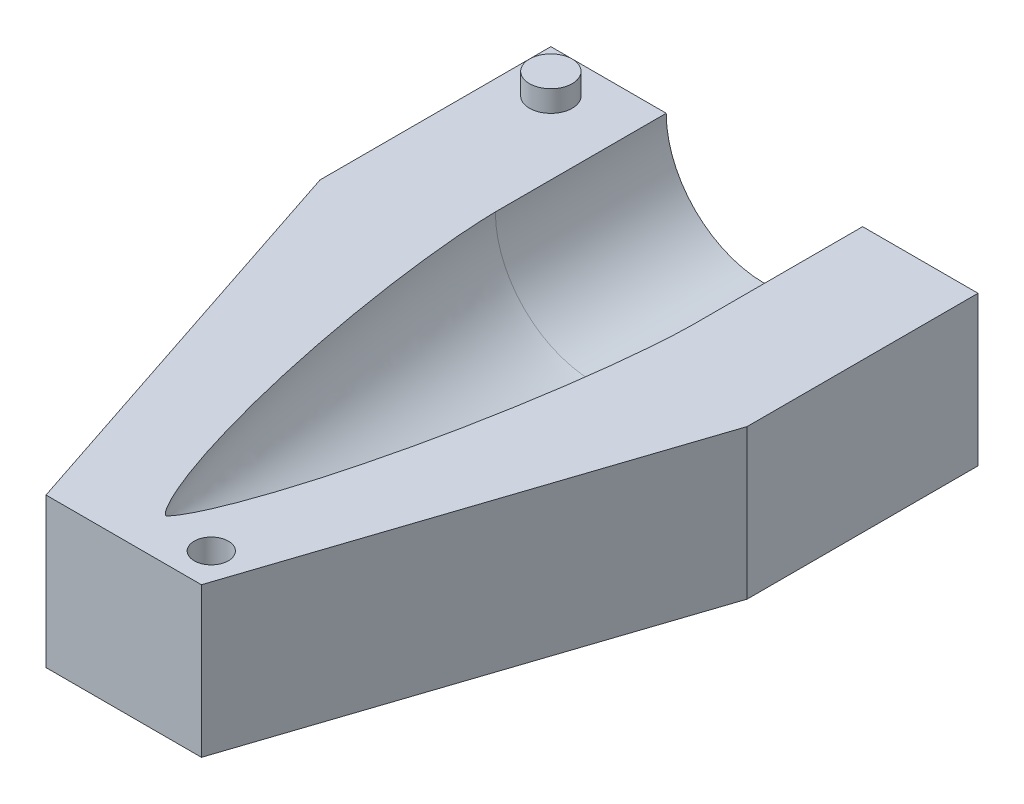
ISO-10303-21;
HEADER;
FILE_DESCRIPTION(('STEP AP214'),'2;1');
FILE_NAME('part.step','',(''),(''),'','','');
FILE_SCHEMA(('AUTOMOTIVE_DESIGN { 1 0 10303 214 1 1 1 1 }'));
ENDSEC;
DATA;
#1=APPLICATION_CONTEXT('core data for automotive mechanical design processes');
#2=APPLICATION_PROTOCOL_DEFINITION('international standard','automotive_design',2000,#1);
#3=PRODUCT_CONTEXT('',#1,'mechanical');
#4=PRODUCT('Part','Part','',(#3));
#5=PRODUCT_RELATED_PRODUCT_CATEGORY('part','',(#4));
#6=PRODUCT_DEFINITION_FORMATION('','',#4);
#7=PRODUCT_DEFINITION_CONTEXT('part definition',#1,'design');
#8=PRODUCT_DEFINITION('design','',#6,#7);
#9=PRODUCT_DEFINITION_SHAPE('','',#8);
#10=(LENGTH_UNIT() NAMED_UNIT(*) SI_UNIT(.MILLI.,.METRE.));
#11=(NAMED_UNIT(*) PLANE_ANGLE_UNIT() SI_UNIT($,.RADIAN.));
#12=(NAMED_UNIT(*) SI_UNIT($,.STERADIAN.) SOLID_ANGLE_UNIT());
#13=UNCERTAINTY_MEASURE_WITH_UNIT(LENGTH_MEASURE(1.E-05),#10,'distance_accuracy_value','');
#14=(GEOMETRIC_REPRESENTATION_CONTEXT(3) GLOBAL_UNCERTAINTY_ASSIGNED_CONTEXT((#13)) GLOBAL_UNIT_ASSIGNED_CONTEXT((#10,
#11,#12)) REPRESENTATION_CONTEXT('',''));
#15=CARTESIAN_POINT('',(0.,0.,0.));
#16=DIRECTION('',(0.,0.,1.));
#17=DIRECTION('',(1.,0.,0.));
#18=AXIS2_PLACEMENT_3D('',#15,#16,#17);
#19=CARTESIAN_POINT('',(0.,0.,0.));
#20=DIRECTION('',(0.,1.,0.));
#21=DIRECTION('',(0.,0.,1.));
#22=AXIS2_PLACEMENT_3D('',#19,#20,#21);
#23=PLANE('',#22);
#24=CARTESIAN_POINT('',(-40.,0.,-130.177152604319));
#25=DIRECTION('',(0.,1.,0.));
#26=DIRECTION('',(0.,0.,1.));
#27=AXIS2_PLACEMENT_3D('',#24,#25,#26);
#28=CIRCLE('',#27,5.);
#29=CARTESIAN_POINT('',(-40.,0.,-125.177152604319));
#30=VERTEX_POINT('',#29);
#31=EDGE_CURVE('E201',#30,#30,#28,.T.);
#32=ORIENTED_EDGE('',*,*,#31,.F.);
#33=EDGE_LOOP('',(#32));
#34=FACE_BOUND('',#33,.T.);
#35=CARTESIAN_POINT('',(12.5,0.,1.8228473956807));
#36=DIRECTION('',(0.,1.,0.));
#37=DIRECTION('',(0.,0.,1.));
#38=AXIS2_PLACEMENT_3D('',#35,#36,#37);
#39=CIRCLE('',#38,3.99999999999999);
#40=CARTESIAN_POINT('',(12.5,0.,5.82284739568069));
#41=VERTEX_POINT('',#40);
#42=EDGE_CURVE('E200',#41,#41,#39,.T.);
#43=ORIENTED_EDGE('',*,*,#42,.F.);
#44=EDGE_LOOP('',(#43));
#45=FACE_BOUND('',#44,.T.);
#46=DIRECTION('',(-0.31461271111549,0.,-0.949220123050792));
#47=VECTOR('',#46,1.);
#48=CARTESIAN_POINT('',(-50.,0.,-86.1379769190762));
#49=LINE('',#48,#47);
#50=CARTESIAN_POINT('',(-18.1944215410112,0.,9.8228473956807));
#51=VERTEX_POINT('',#50);
#52=CARTESIAN_POINT('',(-50.,0.,-86.1379769190762));
#53=VERTEX_POINT('',#52);
#54=EDGE_CURVE('E51',#51,#53,#49,.T.);
#55=ORIENTED_EDGE('',*,*,#54,.F.);
#56=DIRECTION('',(1.,0.,0.));
#57=VECTOR('',#56,1.);
#58=CARTESIAN_POINT('',(50.,0.,9.82284739568071));
#59=LINE('',#58,#57);
#60=CARTESIAN_POINT('',(18.1944215410112,0.,9.82284739568071));
#61=VERTEX_POINT('',#60);
#62=EDGE_CURVE('E219',#51,#61,#59,.T.);
#63=ORIENTED_EDGE('',*,*,#62,.T.);
#64=DIRECTION('',(-0.31461271111549,0.,0.949220123050792));
#65=VECTOR('',#64,1.);
#66=CARTESIAN_POINT('',(50.,0.,-86.1379769190762));
#67=LINE('',#66,#65);
#68=CARTESIAN_POINT('',(50.,0.,-86.1379769190762));
#69=VERTEX_POINT('',#68);
#70=EDGE_CURVE('E104',#69,#61,#67,.T.);
#71=ORIENTED_EDGE('',*,*,#70,.F.);
#72=DIRECTION('',(0.,0.,-1.));
#73=VECTOR('',#72,1.);
#74=CARTESIAN_POINT('',(50.,0.,0.));
#75=LINE('',#74,#73);
#76=CARTESIAN_POINT('',(50.,0.,-140.177152604319));
#77=VERTEX_POINT('',#76);
#78=EDGE_CURVE('E216',#69,#77,#75,.T.);
#79=ORIENTED_EDGE('',*,*,#78,.T.);
#80=DIRECTION('',(-1.,0.,0.));
#81=VECTOR('',#80,1.);
#82=CARTESIAN_POINT('',(50.,0.,-140.177152604319));
#83=LINE('',#82,#81);
#84=CARTESIAN_POINT('',(22.9913156668105,0.,-140.177152604319));
#85=VERTEX_POINT('',#84);
#86=EDGE_CURVE('E222',#77,#85,#83,.T.);
#87=ORIENTED_EDGE('',*,*,#86,.T.);
#88=DIRECTION('',(0.,0.,1.));
#89=VECTOR('',#88,1.);
#90=CARTESIAN_POINT('',(22.9913156668105,0.,0.));
#91=LINE('',#90,#89);
#92=CARTESIAN_POINT('',(22.9913156668105,0.,-100.177152604319));
#93=VERTEX_POINT('',#92);
#94=EDGE_CURVE('E229',#93,#85,#91,.F.);
#95=ORIENTED_EDGE('',*,*,#94,.F.);
#96=CARTESIAN_POINT('',(22.9913156668105,0.,-100.177152604319));
#97=CARTESIAN_POINT('',(22.9913156668105,0.,-99.6773830837032));
#98=CARTESIAN_POINT('',(22.9714099908985,0.,-98.6779967487854));
#99=CARTESIAN_POINT('',(22.875635683383,0.,-96.058091381564));
#100=CARTESIAN_POINT('',(22.6037020160242,0.,-91.8227807600398));
#101=CARTESIAN_POINT('',(22.1286848305687,0.,-86.4776261404894));
#102=CARTESIAN_POINT('',(21.3981607536077,0.,-80.0304974375297));
#103=CARTESIAN_POINT('',(20.5386098353281,0.,-73.5994887283923));
#104=CARTESIAN_POINT('',(19.563313868504,0.,-67.1850290563144));
#105=CARTESIAN_POINT('',(18.4805873670043,0.,-60.7878898986517));
#106=CARTESIAN_POINT('',(17.2939613531271,0.,-54.4091903934157));
#107=CARTESIAN_POINT('',(16.0041295859224,0.,-48.050573204807));
#108=CARTESIAN_POINT('',(14.608588480337,0.,-41.7142661554974));
#109=CARTESIAN_POINT('',(13.1014603152078,0.,-35.4035516128153));
#110=CARTESIAN_POINT('',(11.4726463716587,0.,-29.1230056500835));
#111=CARTESIAN_POINT('',(9.70512739419416,0.,-22.8799735817056));
#112=CARTESIAN_POINT('',(7.81425914639031,0.,-16.8230635383473));
#113=CARTESIAN_POINT('',(5.98538683150435,0.,-11.5994318892449));
#114=CARTESIAN_POINT('',(4.31706153991178,0.,-7.40332814922314));
#115=CARTESIAN_POINT('',(2.96045388006277,0.,-4.44576491835928));
#116=CARTESIAN_POINT('',(2.03469009013861,0.,-2.67850290129982));
#117=CARTESIAN_POINT('',(1.35492318038811,0.,-1.55273765823771));
#118=CARTESIAN_POINT('',(0.902060291211029,0.,-0.901337008533642));
#119=CARTESIAN_POINT('',(0.601235581178347,0.,-0.524430354454517));
#120=CARTESIAN_POINT('',(0.401983994044902,0.,-0.306591117086136));
#121=CARTESIAN_POINT('',(0.271568578547477,0.,-0.181890949137895));
#122=CARTESIAN_POINT('',(0.18355763089567,0.,-0.108056169269483));
#123=CARTESIAN_POINT('',(0.121023529313261,0.,-0.0618261369939828));
#124=CARTESIAN_POINT('',(0.0725878926251186,0.,-0.0309109385181754));
#125=CARTESIAN_POINT('',(0.0363511615834242,0.,-0.0111976924309942));
#126=CARTESIAN_POINT('',(0.0123794988745162,0.,-0.00300104938316236));
#127=CARTESIAN_POINT('',(0.,0.,0.));
#128=B_SPLINE_CURVE_WITH_KNOTS('',4,(#96,#97,#98,#99,#100,#101,#102,#103,#104,#105,#106,#107,
#108,#109,#110,#111,#112,#113,#114,#115,#116,#117,#118,#119,#120,#121,#122,#123,#124,#125,#126,
#127),.UNSPECIFIED.,.F.,.F.,(5,1,1,1,1,1,1,1,1,1,1,1,1,1,1,1,1,1,1,1,1,1,1,1,1,1,1,1,5),(0.,
0.0192882576807905,0.038576515361581,0.101176729872675,0.163776945029332,0.226377163001962,
0.28897737378094,0.351577593164917,0.41417780461237,0.476778019122959,0.539378235463863,
0.601978443197806,0.664578657112351,0.727178867221817,0.789779094894328,0.852379287962573,
0.909435495456412,0.940735609346367,0.963989150052229,0.977912976551439,0.986394042544016,
0.991459623657023,0.994588016567133,0.99651192245248,0.997780202195846,0.998418212786685,
0.999020025882964,0.999510012941482,1.),.UNSPECIFIED.);
#129=CARTESIAN_POINT('',(0.,0.,0.));
#130=VERTEX_POINT('',#129);
#131=EDGE_CURVE('E36',#130,#93,#128,.F.);
#132=ORIENTED_EDGE('',*,*,#131,.F.);
#133=CARTESIAN_POINT('',(-22.9913156668105,0.,-100.177152604319));
#134=CARTESIAN_POINT('',(-22.9913156668105,0.,-99.6773830837032));
#135=CARTESIAN_POINT('',(-22.9714099908985,0.,-98.6779967487854));
#136=CARTESIAN_POINT('',(-22.875635683383,0.,-96.058091381564));
#137=CARTESIAN_POINT('',(-22.6037020160242,0.,-91.8227807600398));
#138=CARTESIAN_POINT('',(-22.1286848305687,0.,-86.4776261404894));
#139=CARTESIAN_POINT('',(-21.3981607536077,0.,-80.0304974375297));
#140=CARTESIAN_POINT('',(-20.5386098353281,0.,-73.5994887283923));
#141=CARTESIAN_POINT('',(-19.563313868504,0.,-67.1850290563144));
#142=CARTESIAN_POINT('',(-18.4805873670043,0.,-60.7878898986517));
#143=CARTESIAN_POINT('',(-17.2939613531271,0.,-54.4091903934157));
#144=CARTESIAN_POINT('',(-16.0041295859224,0.,-48.050573204807));
#145=CARTESIAN_POINT('',(-14.608588480337,0.,-41.7142661554974));
#146=CARTESIAN_POINT('',(-13.1014603152078,0.,-35.4035516128153));
#147=CARTESIAN_POINT('',(-11.4726463716587,0.,-29.1230056500835));
#148=CARTESIAN_POINT('',(-9.70512739419416,0.,-22.8799735817056));
#149=CARTESIAN_POINT('',(-7.81425914639031,0.,-16.8230635383473));
#150=CARTESIAN_POINT('',(-5.98538683150435,0.,-11.5994318892449));
#151=CARTESIAN_POINT('',(-4.31706153991178,0.,-7.40332814922314));
#152=CARTESIAN_POINT('',(-2.96045388006277,0.,-4.44576491835928));
#153=CARTESIAN_POINT('',(-2.03469009013861,0.,-2.67850290129982));
#154=CARTESIAN_POINT('',(-1.35492318038811,0.,-1.55273765823771));
#155=CARTESIAN_POINT('',(-0.902060291211029,0.,-0.901337008533642));
#156=CARTESIAN_POINT('',(-0.601235581178347,0.,-0.524430354454517));
#157=CARTESIAN_POINT('',(-0.401983994044902,0.,-0.306591117086136));
#158=CARTESIAN_POINT('',(-0.271568578547477,0.,-0.181890949137895));
#159=CARTESIAN_POINT('',(-0.18355763089567,0.,-0.108056169269483));
#160=CARTESIAN_POINT('',(-0.121023529313261,0.,-0.0618261369939828));
#161=CARTESIAN_POINT('',(-0.0725878926251186,0.,-0.0309109385181754));
#162=CARTESIAN_POINT('',(-0.0363511615834242,0.,-0.0111976924309942));
#163=CARTESIAN_POINT('',(-0.0123794988745162,0.,-0.00300104938316236));
#164=CARTESIAN_POINT('',(0.,0.,0.));
#165=B_SPLINE_CURVE_WITH_KNOTS('',4,(#133,#134,#135,#136,#137,#138,#139,#140,#141,#142,#143,
#144,#145,#146,#147,#148,#149,#150,#151,#152,#153,#154,#155,#156,#157,#158,#159,#160,#161,#162,
#163,#164),.UNSPECIFIED.,.F.,.F.,(5,1,1,1,1,1,1,1,1,1,1,1,1,1,1,1,1,1,1,1,1,1,1,1,1,1,1,1,5),
(0.,0.0192882576807905,0.038576515361581,0.101176729872675,0.163776945029332,0.226377163001962,
0.28897737378094,0.351577593164917,0.41417780461237,0.476778019122959,0.539378235463863,
0.601978443197806,0.664578657112351,0.727178867221817,0.789779094894328,0.852379287962573,
0.909435495456412,0.940735609346367,0.963989150052229,0.977912976551439,0.986394042544016,
0.991459623657023,0.994588016567133,0.99651192245248,0.997780202195846,0.998418212786685,
0.999020025882964,0.999510012941482,1.),.UNSPECIFIED.);
#166=CARTESIAN_POINT('',(-22.9913156668105,0.,-100.177152604319));
#167=VERTEX_POINT('',#166);
#168=EDGE_CURVE('E129',#167,#130,#165,.T.);
#169=ORIENTED_EDGE('',*,*,#168,.F.);
#170=DIRECTION('',(0.,0.,1.));
#171=VECTOR('',#170,1.);
#172=CARTESIAN_POINT('',(-22.9913156668105,0.,0.));
#173=LINE('',#172,#171);
#174=CARTESIAN_POINT('',(-22.9913156668105,0.,-140.177152604319));
#175=VERTEX_POINT('',#174);
#176=EDGE_CURVE('E226',#175,#167,#173,.T.);
#177=ORIENTED_EDGE('',*,*,#176,.F.);
#178=CARTESIAN_POINT('',(-50.,0.,-140.177152604319));
#179=VERTEX_POINT('',#178);
#180=EDGE_CURVE('E146',#175,#179,#83,.T.);
#181=ORIENTED_EDGE('',*,*,#180,.T.);
#182=DIRECTION('',(0.,0.,-1.));
#183=VECTOR('',#182,1.);
#184=CARTESIAN_POINT('',(-50.,0.,0.));
#185=LINE('',#184,#183);
#186=EDGE_CURVE('E221',#53,#179,#185,.T.);
#187=ORIENTED_EDGE('',*,*,#186,.F.);
#188=EDGE_LOOP('',(#55,#63,#71,#79,#87,#95,#132,#169,#177,#181,#187));
#189=FACE_BOUND('',#188,.T.);
#190=ADVANCED_FACE('F33',(#34,#45,#189),#23,.T.);
#191=CARTESIAN_POINT('',(50.,-35.,-140.177152604319));
#192=DIRECTION('',(0.,1.,0.));
#193=DIRECTION('',(0.,0.,1.));
#194=AXIS2_PLACEMENT_3D('',#191,#192,#193);
#195=PLANE('',#194);
#196=DIRECTION('',(-1.,0.,0.));
#197=VECTOR('',#196,1.);
#198=CARTESIAN_POINT('',(50.,-35.,9.82284739568071));
#199=LINE('',#198,#197);
#200=CARTESIAN_POINT('',(18.1944215410112,-35.,9.82284739568071));
#201=VERTEX_POINT('',#200);
#202=CARTESIAN_POINT('',(-18.1944215410112,-35.,9.8228473956807));
#203=VERTEX_POINT('',#202);
#204=EDGE_CURVE('E117',#201,#203,#199,.T.);
#205=ORIENTED_EDGE('',*,*,#204,.T.);
#206=DIRECTION('',(-0.31461271111549,0.,-0.949220123050792));
#207=VECTOR('',#206,1.);
#208=CARTESIAN_POINT('',(-50.,-35.,-86.1379769190762));
#209=LINE('',#208,#207);
#210=CARTESIAN_POINT('',(-50.,-35.,-86.1379769190762));
#211=VERTEX_POINT('',#210);
#212=EDGE_CURVE('E120',#203,#211,#209,.T.);
#213=ORIENTED_EDGE('',*,*,#212,.T.);
#214=DIRECTION('',(0.,0.,-1.));
#215=VECTOR('',#214,1.);
#216=CARTESIAN_POINT('',(-50.,-35.,-140.177152604319));
#217=LINE('',#216,#215);
#218=CARTESIAN_POINT('',(-50.,-35.,-140.177152604319));
#219=VERTEX_POINT('',#218);
#220=EDGE_CURVE('E132',#211,#219,#217,.T.);
#221=ORIENTED_EDGE('',*,*,#220,.T.);
#222=DIRECTION('',(-1.,0.,0.));
#223=VECTOR('',#222,1.);
#224=CARTESIAN_POINT('',(50.,-35.,-140.177152604319));
#225=LINE('',#224,#223);
#226=CARTESIAN_POINT('',(50.,-35.,-140.177152604319));
#227=VERTEX_POINT('',#226);
#228=EDGE_CURVE('E124',#227,#219,#225,.T.);
#229=ORIENTED_EDGE('',*,*,#228,.F.);
#230=DIRECTION('',(0.,0.,-1.));
#231=VECTOR('',#230,1.);
#232=CARTESIAN_POINT('',(50.,-35.,-140.177152604319));
#233=LINE('',#232,#231);
#234=CARTESIAN_POINT('',(50.,-35.,-86.1379769190762));
#235=VERTEX_POINT('',#234);
#236=EDGE_CURVE('E119',#235,#227,#233,.T.);
#237=ORIENTED_EDGE('',*,*,#236,.F.);
#238=DIRECTION('',(-0.31461271111549,0.,0.949220123050792));
#239=VECTOR('',#238,1.);
#240=CARTESIAN_POINT('',(50.,-35.,-86.1379769190762));
#241=LINE('',#240,#239);
#242=EDGE_CURVE('E59',#235,#201,#241,.T.);
#243=ORIENTED_EDGE('',*,*,#242,.T.);
#244=EDGE_LOOP('',(#205,#213,#221,#229,#237,#243));
#245=FACE_BOUND('',#244,.T.);
#246=ADVANCED_FACE('F115',(#245),#195,.F.);
#247=CARTESIAN_POINT('',(50.,35.,-140.177152604319));
#248=DIRECTION('',(0.,0.,1.));
#249=DIRECTION('',(1.,0.,0.));
#250=AXIS2_PLACEMENT_3D('',#247,#248,#249);
#251=PLANE('',#250);
#252=ORIENTED_EDGE('',*,*,#86,.F.);
#253=DIRECTION('',(0.,1.,0.));
#254=VECTOR('',#253,1.);
#255=CARTESIAN_POINT('',(50.,35.,-140.177152604319));
#256=LINE('',#255,#254);
#257=EDGE_CURVE('E135',#227,#77,#256,.T.);
#258=ORIENTED_EDGE('',*,*,#257,.F.);
#259=ORIENTED_EDGE('',*,*,#228,.T.);
#260=DIRECTION('',(0.,1.,0.));
#261=VECTOR('',#260,1.);
#262=CARTESIAN_POINT('',(-50.,35.,-140.177152604319));
#263=LINE('',#262,#261);
#264=EDGE_CURVE('E134',#219,#179,#263,.T.);
#265=ORIENTED_EDGE('',*,*,#264,.T.);
#266=ORIENTED_EDGE('',*,*,#180,.F.);
#267=CARTESIAN_POINT('',(0.,0.,-140.177152604319));
#268=DIRECTION('',(0.,0.,1.));
#269=DIRECTION('',(1.,0.,0.));
#270=AXIS2_PLACEMENT_3D('',#267,#268,#269);
#271=CIRCLE('',#270,22.9913156668105);
#272=EDGE_CURVE('E43',#175,#85,#271,.T.);
#273=ORIENTED_EDGE('',*,*,#272,.T.);
#274=EDGE_LOOP('',(#252,#258,#259,#265,#266,#273));
#275=FACE_BOUND('',#274,.T.);
#276=ADVANCED_FACE('F158',(#275),#251,.F.);
#277=CARTESIAN_POINT('',(0.,0.,0.));
#278=DIRECTION('',(0.,0.,1.));
#279=DIRECTION('',(1.,0.,0.));
#280=AXIS2_PLACEMENT_3D('',#277,#278,#279);
#281=CYLINDRICAL_SURFACE('',#280,22.9913156668105);
#282=ORIENTED_EDGE('',*,*,#272,.F.);
#283=ORIENTED_EDGE('',*,*,#176,.T.);
#284=CARTESIAN_POINT('',(0.,0.,-100.177152604319));
#285=DIRECTION('',(0.,0.,1.));
#286=DIRECTION('',(1.,0.,0.));
#287=AXIS2_PLACEMENT_3D('',#284,#285,#286);
#288=CIRCLE('',#287,22.9913156668105);
#289=EDGE_CURVE('E12',#167,#93,#288,.T.);
#290=ORIENTED_EDGE('',*,*,#289,.T.);
#291=ORIENTED_EDGE('',*,*,#94,.T.);
#292=EDGE_LOOP('',(#282,#283,#290,#291));
#293=FACE_BOUND('',#292,.T.);
#294=ADVANCED_FACE('F154',(#293),#281,.F.);
#295=CARTESIAN_POINT('',(0.,22.9913156668105,-100.177152604319));
#296=CARTESIAN_POINT('',(0.,22.9913156668105,-99.6773830837032));
#297=CARTESIAN_POINT('',(0.,22.9714099908985,-98.6779967487854));
#298=CARTESIAN_POINT('',(0.,22.875635683383,-96.058091381564));
#299=CARTESIAN_POINT('',(0.,22.6037020160242,-91.8227807600398));
#300=CARTESIAN_POINT('',(0.,22.1286848305687,-86.4776261404894));
#301=CARTESIAN_POINT('',(0.,21.3981607536077,-80.0304974375297));
#302=CARTESIAN_POINT('',(0.,20.5386098353281,-73.5994887283923));
#303=CARTESIAN_POINT('',(0.,19.563313868504,-67.1850290563144));
#304=CARTESIAN_POINT('',(0.,18.4805873670043,-60.7878898986517));
#305=CARTESIAN_POINT('',(0.,17.2939613531271,-54.4091903934157));
#306=CARTESIAN_POINT('',(0.,16.0041295859224,-48.050573204807));
#307=CARTESIAN_POINT('',(0.,14.608588480337,-41.7142661554974));
#308=CARTESIAN_POINT('',(0.,13.1014603152078,-35.4035516128153));
#309=CARTESIAN_POINT('',(0.,11.4726463716587,-29.1230056500835));
#310=CARTESIAN_POINT('',(0.,9.70512739419416,-22.8799735817056));
#311=CARTESIAN_POINT('',(0.,7.81425914639031,-16.8230635383473));
#312=CARTESIAN_POINT('',(0.,5.98538683150435,-11.5994318892449));
#313=CARTESIAN_POINT('',(0.,4.31706153991178,-7.40332814922314));
#314=CARTESIAN_POINT('',(0.,2.96045388006277,-4.44576491835928));
#315=CARTESIAN_POINT('',(0.,2.03469009013861,-2.67850290129982));
#316=CARTESIAN_POINT('',(0.,1.35492318038811,-1.55273765823771));
#317=CARTESIAN_POINT('',(0.,0.902060291211029,-0.901337008533642));
#318=CARTESIAN_POINT('',(0.,0.601235581178347,-0.524430354454517));
#319=CARTESIAN_POINT('',(0.,0.401983994044902,-0.306591117086136));
#320=CARTESIAN_POINT('',(0.,0.271568578547477,-0.181890949137895));
#321=CARTESIAN_POINT('',(0.,0.18355763089567,-0.108056169269483));
#322=CARTESIAN_POINT('',(0.,0.121023529313261,-0.0618261369939828));
#323=CARTESIAN_POINT('',(0.,0.0725878926251186,-0.0309109385181754));
#324=CARTESIAN_POINT('',(0.,0.0363511615834242,-0.0111976924309942));
#325=CARTESIAN_POINT('',(0.,0.0123794988745162,-0.00300104938316236));
#326=CARTESIAN_POINT('',(0.,0.,0.));
#327=B_SPLINE_CURVE_WITH_KNOTS('',4,(#295,#296,#297,#298,#299,#300,#301,#302,#303,#304,#305,
#306,#307,#308,#309,#310,#311,#312,#313,#314,#315,#316,#317,#318,#319,#320,#321,#322,#323,#324,
#325,#326),.UNSPECIFIED.,.F.,.F.,(5,1,1,1,1,1,1,1,1,1,1,1,1,1,1,1,1,1,1,1,1,1,1,1,1,1,1,1,5),
(0.,0.0192882576807905,0.038576515361581,0.101176729872675,0.163776945029332,0.226377163001962,
0.28897737378094,0.351577593164917,0.41417780461237,0.476778019122959,0.539378235463863,
0.601978443197806,0.664578657112351,0.727178867221817,0.789779094894328,0.852379287962573,
0.909435495456412,0.940735609346367,0.963989150052229,0.977912976551439,0.986394042544016,
0.991459623657023,0.994588016567133,0.99651192245248,0.997780202195846,0.998418212786685,
0.999020025882964,0.999510012941482,1.),.UNSPECIFIED.);
#328=CARTESIAN_POINT('',(0.,0.,0.));
#329=DIRECTION('',(0.,0.,1.));
#330=AXIS1_PLACEMENT('',#328,#329);
#331=SURFACE_OF_REVOLUTION('',#327,#330);
#332=ORIENTED_EDGE('',*,*,#289,.F.);
#333=ORIENTED_EDGE('',*,*,#168,.T.);
#334=ORIENTED_EDGE('',*,*,#131,.T.);
#335=EDGE_LOOP('',(#332,#333,#334));
#336=FACE_BOUND('',#335,.T.);
#337=ADVANCED_FACE('F151',(#336),#331,.F.);
#338=CARTESIAN_POINT('',(50.,35.,9.82284739568071));
#339=DIRECTION('',(0.,0.,-1.));
#340=DIRECTION('',(-1.,0.,0.));
#341=AXIS2_PLACEMENT_3D('',#338,#339,#340);
#342=PLANE('',#341);
#343=ORIENTED_EDGE('',*,*,#62,.F.);
#344=DIRECTION('',(0.,1.,0.));
#345=VECTOR('',#344,1.);
#346=CARTESIAN_POINT('',(-18.1944215410112,-35.,9.8228473956807));
#347=LINE('',#346,#345);
#348=EDGE_CURVE('E109',#203,#51,#347,.T.);
#349=ORIENTED_EDGE('',*,*,#348,.F.);
#350=ORIENTED_EDGE('',*,*,#204,.F.);
#351=DIRECTION('',(0.,1.,0.));
#352=VECTOR('',#351,1.);
#353=CARTESIAN_POINT('',(18.1944215410112,-35.,9.82284739568071));
#354=LINE('',#353,#352);
#355=EDGE_CURVE('E101',#201,#61,#354,.T.);
#356=ORIENTED_EDGE('',*,*,#355,.T.);
#357=EDGE_LOOP('',(#343,#349,#350,#356));
#358=FACE_BOUND('',#357,.T.);
#359=ADVANCED_FACE('F123',(#358),#342,.F.);
#360=CARTESIAN_POINT('',(-50.,0.,0.));
#361=DIRECTION('',(-1.,0.,0.));
#362=DIRECTION('',(0.,0.,1.));
#363=AXIS2_PLACEMENT_3D('',#360,#361,#362);
#364=PLANE('',#363);
#365=DIRECTION('',(0.,1.,0.));
#366=VECTOR('',#365,1.);
#367=CARTESIAN_POINT('',(-50.,-35.,-86.1379769190762));
#368=LINE('',#367,#366);
#369=EDGE_CURVE('E214',#211,#53,#368,.T.);
#370=ORIENTED_EDGE('',*,*,#369,.T.);
#371=ORIENTED_EDGE('',*,*,#186,.T.);
#372=ORIENTED_EDGE('',*,*,#264,.F.);
#373=ORIENTED_EDGE('',*,*,#220,.F.);
#374=EDGE_LOOP('',(#370,#371,#372,#373));
#375=FACE_BOUND('',#374,.T.);
#376=ADVANCED_FACE('F160',(#375),#364,.T.);
#377=CARTESIAN_POINT('',(50.,0.,0.));
#378=DIRECTION('',(-1.,0.,0.));
#379=DIRECTION('',(0.,0.,1.));
#380=AXIS2_PLACEMENT_3D('',#377,#378,#379);
#381=PLANE('',#380);
#382=ORIENTED_EDGE('',*,*,#78,.F.);
#383=DIRECTION('',(0.,1.,0.));
#384=VECTOR('',#383,1.);
#385=CARTESIAN_POINT('',(50.,-35.,-86.1379769190762));
#386=LINE('',#385,#384);
#387=EDGE_CURVE('E110',#235,#69,#386,.T.);
#388=ORIENTED_EDGE('',*,*,#387,.F.);
#389=ORIENTED_EDGE('',*,*,#236,.T.);
#390=ORIENTED_EDGE('',*,*,#257,.T.);
#391=EDGE_LOOP('',(#382,#388,#389,#390));
#392=FACE_BOUND('',#391,.T.);
#393=ADVANCED_FACE('F163',(#392),#381,.F.);
#394=CARTESIAN_POINT('',(50.,-35.,-86.1379769190762));
#395=DIRECTION('',(-0.949220123050792,0.,-0.31461271111549));
#396=DIRECTION('',(-0.31461271111549,0.,0.949220123050792));
#397=AXIS2_PLACEMENT_3D('',#394,#395,#396);
#398=PLANE('',#397);
#399=ORIENTED_EDGE('',*,*,#70,.T.);
#400=ORIENTED_EDGE('',*,*,#355,.F.);
#401=ORIENTED_EDGE('',*,*,#242,.F.);
#402=ORIENTED_EDGE('',*,*,#387,.T.);
#403=EDGE_LOOP('',(#399,#400,#401,#402));
#404=FACE_BOUND('',#403,.T.);
#405=ADVANCED_FACE('F102',(#404),#398,.F.);
#406=CARTESIAN_POINT('',(-50.,-35.,-86.1379769190762));
#407=DIRECTION('',(0.949220123050792,0.,-0.31461271111549));
#408=DIRECTION('',(-0.31461271111549,0.,-0.949220123050792));
#409=AXIS2_PLACEMENT_3D('',#406,#407,#408);
#410=PLANE('',#409);
#411=ORIENTED_EDGE('',*,*,#54,.T.);
#412=ORIENTED_EDGE('',*,*,#369,.F.);
#413=ORIENTED_EDGE('',*,*,#212,.F.);
#414=ORIENTED_EDGE('',*,*,#348,.T.);
#415=EDGE_LOOP('',(#411,#412,#413,#414));
#416=FACE_BOUND('',#415,.T.);
#417=ADVANCED_FACE('F177',(#416),#410,.F.);
#418=CARTESIAN_POINT('',(12.5,-6.,1.8228473956807));
#419=DIRECTION('',(0.,1.,0.));
#420=DIRECTION('',(0.,0.,1.));
#421=AXIS2_PLACEMENT_3D('',#418,#419,#420);
#422=CYLINDRICAL_SURFACE('',#421,3.99999999999999);
#423=CARTESIAN_POINT('',(12.5,-6.,1.8228473956807));
#424=DIRECTION('',(0.,1.,0.));
#425=DIRECTION('',(0.,0.,1.));
#426=AXIS2_PLACEMENT_3D('',#423,#424,#425);
#427=CIRCLE('',#426,3.99999999999999);
#428=CARTESIAN_POINT('',(12.5,-6.,5.82284739568069));
#429=VERTEX_POINT('',#428);
#430=EDGE_CURVE('E204',#429,#429,#427,.T.);
#431=ORIENTED_EDGE('',*,*,#430,.F.);
#432=EDGE_LOOP('',(#431));
#433=FACE_BOUND('',#432,.T.);
#434=ORIENTED_EDGE('',*,*,#42,.T.);
#435=EDGE_LOOP('',(#434));
#436=FACE_BOUND('',#435,.T.);
#437=ADVANCED_FACE('F180',(#433,#436),#422,.F.);
#438=CARTESIAN_POINT('',(12.5,-6.,1.8228473956807));
#439=DIRECTION('',(0.,1.,0.));
#440=DIRECTION('',(0.,0.,1.));
#441=AXIS2_PLACEMENT_3D('',#438,#439,#440);
#442=PLANE('',#441);
#443=ORIENTED_EDGE('',*,*,#430,.T.);
#444=EDGE_LOOP('',(#443));
#445=FACE_BOUND('',#444,.T.);
#446=ADVANCED_FACE('F183',(#445),#442,.T.);
#447=CARTESIAN_POINT('',(-40.,5.,-130.177152604319));
#448=DIRECTION('',(0.,-1.,0.));
#449=DIRECTION('',(0.,0.,-1.));
#450=AXIS2_PLACEMENT_3D('',#447,#448,#449);
#451=CYLINDRICAL_SURFACE('',#450,5.);
#452=CARTESIAN_POINT('',(-40.,5.,-130.177152604319));
#453=DIRECTION('',(0.,1.,0.));
#454=DIRECTION('',(0.,0.,1.));
#455=AXIS2_PLACEMENT_3D('',#452,#453,#454);
#456=CIRCLE('',#455,5.);
#457=CARTESIAN_POINT('',(-40.,5.,-125.177152604319));
#458=VERTEX_POINT('',#457);
#459=EDGE_CURVE('E199',#458,#458,#456,.T.);
#460=ORIENTED_EDGE('',*,*,#459,.F.);
#461=EDGE_LOOP('',(#460));
#462=FACE_BOUND('',#461,.T.);
#463=ORIENTED_EDGE('',*,*,#31,.T.);
#464=EDGE_LOOP('',(#463));
#465=FACE_BOUND('',#464,.T.);
#466=ADVANCED_FACE('F187',(#462,#465),#451,.T.);
#467=CARTESIAN_POINT('',(-40.,5.,-130.177152604319));
#468=DIRECTION('',(0.,1.,0.));
#469=DIRECTION('',(0.,0.,1.));
#470=AXIS2_PLACEMENT_3D('',#467,#468,#469);
#471=PLANE('',#470);
#472=ORIENTED_EDGE('',*,*,#459,.T.);
#473=EDGE_LOOP('',(#472));
#474=FACE_BOUND('',#473,.T.);
#475=ADVANCED_FACE('F191',(#474),#471,.T.);
#476=CLOSED_SHELL('',(#190,#246,#276,#294,#337,#359,#376,#393,#405,#417,#437,#446,#466,#475));
#477=MANIFOLD_SOLID_BREP('B2',#476);
#478=ADVANCED_BREP_SHAPE_REPRESENTATION('',(#18,#477),#14);
#479=SHAPE_DEFINITION_REPRESENTATION(#9,#478);
ENDSEC;
END-ISO-10303-21;
